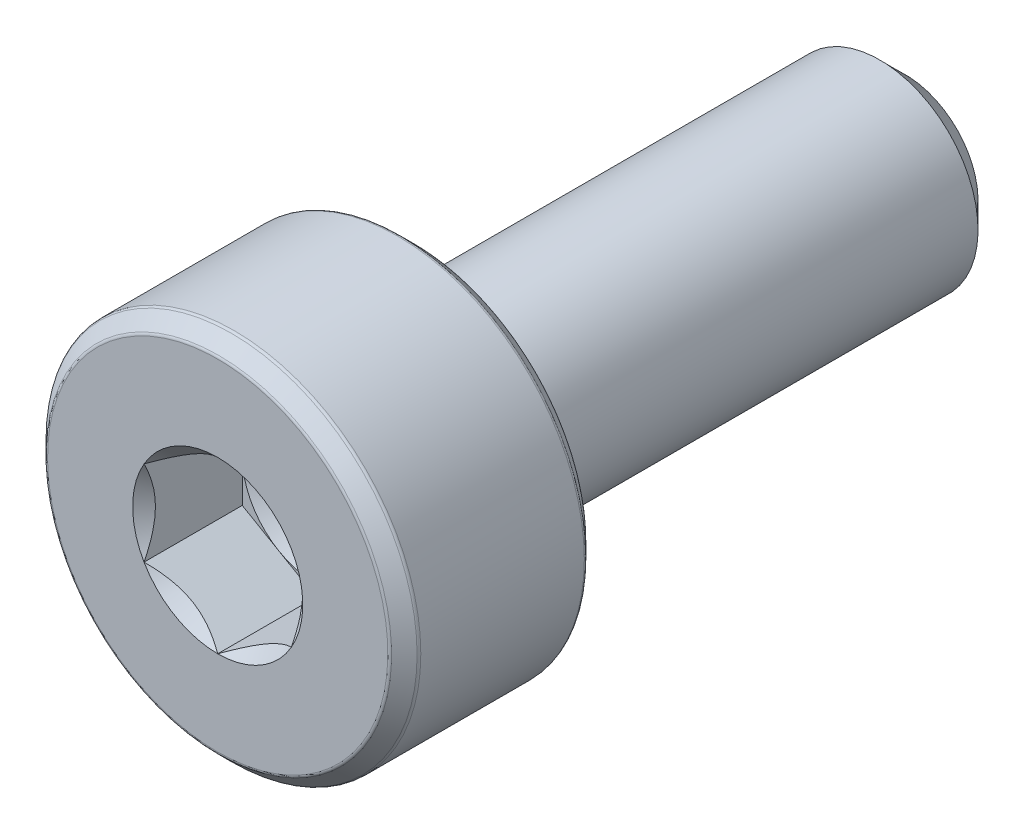
ISO-10303-21;
HEADER;
FILE_DESCRIPTION(('STEP AP214'),'2;1');
FILE_NAME('part.step','',(''),(''),'','','');
FILE_SCHEMA(('AUTOMOTIVE_DESIGN { 1 0 10303 214 1 1 1 1 }'));
ENDSEC;
DATA;
#1=APPLICATION_CONTEXT('core data for automotive mechanical design processes');
#2=APPLICATION_PROTOCOL_DEFINITION('international standard','automotive_design',2000,#1);
#3=PRODUCT_CONTEXT('',#1,'mechanical');
#4=PRODUCT('Part','Part','',(#3));
#5=PRODUCT_RELATED_PRODUCT_CATEGORY('part','',(#4));
#6=PRODUCT_DEFINITION_FORMATION('','',#4);
#7=PRODUCT_DEFINITION_CONTEXT('part definition',#1,'design');
#8=PRODUCT_DEFINITION('design','',#6,#7);
#9=PRODUCT_DEFINITION_SHAPE('','',#8);
#10=(LENGTH_UNIT() NAMED_UNIT(*) SI_UNIT(.MILLI.,.METRE.));
#11=(NAMED_UNIT(*) PLANE_ANGLE_UNIT() SI_UNIT($,.RADIAN.));
#12=(NAMED_UNIT(*) SI_UNIT($,.STERADIAN.) SOLID_ANGLE_UNIT());
#13=UNCERTAINTY_MEASURE_WITH_UNIT(LENGTH_MEASURE(1.E-05),#10,'distance_accuracy_value','');
#14=(GEOMETRIC_REPRESENTATION_CONTEXT(3) GLOBAL_UNCERTAINTY_ASSIGNED_CONTEXT((#13)) GLOBAL_UNIT_ASSIGNED_CONTEXT((#10,
#11,#12)) REPRESENTATION_CONTEXT('',''));
#15=CARTESIAN_POINT('',(0.,0.,0.));
#16=DIRECTION('',(0.,0.,1.));
#17=DIRECTION('',(1.,0.,0.));
#18=AXIS2_PLACEMENT_3D('',#15,#16,#17);
#19=CARTESIAN_POINT('',(0.,0.75,2.5));
#20=DIRECTION('',(0.,0.,-1.));
#21=DIRECTION('',(0.,1.,0.));
#22=AXIS2_PLACEMENT_3D('',#19,#20,#21);
#23=PLANE('',#22);
#24=DIRECTION('',(-0.866025403784439,0.5,0.));
#25=VECTOR('',#24,1.);
#26=CARTESIAN_POINT('',(0.749999999999997,0.433012701892221,2.5));
#27=LINE('',#26,#25);
#28=CARTESIAN_POINT('',(0.749999999999997,0.433012701892221,2.5));
#29=VERTEX_POINT('',#28);
#30=CARTESIAN_POINT('',(0.374999999999999,0.64951905283833,2.5));
#31=VERTEX_POINT('',#30);
#32=EDGE_CURVE('E311',#29,#31,#27,.T.);
#33=ORIENTED_EDGE('',*,*,#32,.T.);
#34=CARTESIAN_POINT('',(0.,0.,2.5));
#35=DIRECTION('',(0.,0.,1.));
#36=DIRECTION('',(1.,0.,0.));
#37=AXIS2_PLACEMENT_3D('',#34,#35,#36);
#38=CIRCLE('',#37,0.749999999999997);
#39=CARTESIAN_POINT('',(0.749999999999997,0.,2.5));
#40=VERTEX_POINT('',#39);
#41=EDGE_CURVE('E55',#40,#31,#38,.T.);
#42=ORIENTED_EDGE('',*,*,#41,.F.);
#43=DIRECTION('',(0.,1.,0.));
#44=VECTOR('',#43,1.);
#45=CARTESIAN_POINT('',(0.749999999999997,-0.433012701892215,2.5));
#46=LINE('',#45,#44);
#47=EDGE_CURVE('E62',#40,#29,#46,.T.);
#48=ORIENTED_EDGE('',*,*,#47,.T.);
#49=EDGE_LOOP('',(#33,#42,#48));
#50=FACE_BOUND('',#49,.T.);
#51=ADVANCED_FACE('F38',(#50),#23,.F.);
#52=CARTESIAN_POINT('',(0.749999999999997,-0.433012701892215,2.5));
#53=VERTEX_POINT('',#52);
#54=EDGE_CURVE('E191',#53,#40,#46,.T.);
#55=ORIENTED_EDGE('',*,*,#54,.T.);
#56=CARTESIAN_POINT('',(0.,0.,2.5));
#57=DIRECTION('',(0.,0.,-1.));
#58=DIRECTION('',(0.,1.,0.));
#59=AXIS2_PLACEMENT_3D('',#56,#57,#58);
#60=CIRCLE('',#59,0.749999999999997);
#61=CARTESIAN_POINT('',(0.374999999999999,-0.649519052838324,2.5));
#62=VERTEX_POINT('',#61);
#63=EDGE_CURVE('E11',#40,#62,#60,.T.);
#64=ORIENTED_EDGE('',*,*,#63,.T.);
#65=DIRECTION('',(0.866025403784439,0.5,0.));
#66=VECTOR('',#65,1.);
#67=CARTESIAN_POINT('',(0.,-0.866025403784432,2.5));
#68=LINE('',#67,#66);
#69=EDGE_CURVE('E186',#62,#53,#68,.T.);
#70=ORIENTED_EDGE('',*,*,#69,.T.);
#71=EDGE_LOOP('',(#55,#64,#70));
#72=FACE_BOUND('',#71,.T.);
#73=ADVANCED_FACE('F125',(#72),#23,.F.);
#74=CARTESIAN_POINT('',(0.,-0.866025403784432,2.5));
#75=VERTEX_POINT('',#74);
#76=EDGE_CURVE('E187',#75,#62,#68,.T.);
#77=ORIENTED_EDGE('',*,*,#76,.T.);
#78=CARTESIAN_POINT('',(-0.374999999999998,-0.649519052838324,2.5));
#79=VERTEX_POINT('',#78);
#80=EDGE_CURVE('E48',#62,#79,#60,.T.);
#81=ORIENTED_EDGE('',*,*,#80,.T.);
#82=DIRECTION('',(0.866025403784439,-0.5,0.));
#83=VECTOR('',#82,1.);
#84=CARTESIAN_POINT('',(-0.749999999999997,-0.433012701892215,2.5));
#85=LINE('',#84,#83);
#86=EDGE_CURVE('E173',#79,#75,#85,.T.);
#87=ORIENTED_EDGE('',*,*,#86,.T.);
#88=EDGE_LOOP('',(#77,#81,#87));
#89=FACE_BOUND('',#88,.T.);
#90=ADVANCED_FACE('F131',(#89),#23,.F.);
#91=CARTESIAN_POINT('',(-0.749999999999997,-0.433012701892215,2.5));
#92=VERTEX_POINT('',#91);
#93=EDGE_CURVE('E178',#92,#79,#85,.T.);
#94=ORIENTED_EDGE('',*,*,#93,.T.);
#95=CARTESIAN_POINT('',(-0.749999999999997,0.,2.5));
#96=VERTEX_POINT('',#95);
#97=EDGE_CURVE('E265',#79,#96,#60,.T.);
#98=ORIENTED_EDGE('',*,*,#97,.T.);
#99=DIRECTION('',(0.,-1.,0.));
#100=VECTOR('',#99,1.);
#101=CARTESIAN_POINT('',(-0.749999999999997,0.433012701892221,2.5));
#102=LINE('',#101,#100);
#103=EDGE_CURVE('E174',#96,#92,#102,.T.);
#104=ORIENTED_EDGE('',*,*,#103,.T.);
#105=EDGE_LOOP('',(#94,#98,#104));
#106=FACE_BOUND('',#105,.T.);
#107=ADVANCED_FACE('F152',(#106),#23,.F.);
#108=CARTESIAN_POINT('',(-0.749999999999997,0.433012701892221,2.5));
#109=VERTEX_POINT('',#108);
#110=EDGE_CURVE('E164',#109,#96,#102,.T.);
#111=ORIENTED_EDGE('',*,*,#110,.T.);
#112=CARTESIAN_POINT('',(-0.374999999999999,0.649519052838329,2.5));
#113=VERTEX_POINT('',#112);
#114=EDGE_CURVE('E165',#96,#113,#60,.T.);
#115=ORIENTED_EDGE('',*,*,#114,.T.);
#116=DIRECTION('',(-0.866025403784439,-0.5,0.));
#117=VECTOR('',#116,1.);
#118=CARTESIAN_POINT('',(0.,0.866025403784438,2.5));
#119=LINE('',#118,#117);
#120=EDGE_CURVE('E167',#113,#109,#119,.T.);
#121=ORIENTED_EDGE('',*,*,#120,.T.);
#122=EDGE_LOOP('',(#111,#115,#121));
#123=FACE_BOUND('',#122,.T.);
#124=ADVANCED_FACE('F139',(#123),#23,.F.);
#125=CARTESIAN_POINT('',(0.,1.73225988462982,3.5));
#126=DIRECTION('',(0.,0.,-1.));
#127=DIRECTION('',(0.,1.,0.));
#128=AXIS2_PLACEMENT_3D('',#125,#126,#127);
#129=PLANE('',#128);
#130=CARTESIAN_POINT('',(0.,0.,3.5));
#131=DIRECTION('',(0.,0.,1.));
#132=DIRECTION('',(1.,0.,0.));
#133=AXIS2_PLACEMENT_3D('',#130,#131,#132);
#134=CIRCLE('',#133,0.866025403784437);
#135=CARTESIAN_POINT('',(0.,0.866025403784437,3.5));
#136=VERTEX_POINT('',#135);
#137=CARTESIAN_POINT('',(-0.749999999999997,0.433012701892221,3.5));
#138=VERTEX_POINT('',#137);
#139=EDGE_CURVE('E288',#136,#138,#134,.T.);
#140=ORIENTED_EDGE('',*,*,#139,.F.);
#141=CARTESIAN_POINT('',(0.,0.,3.5));
#142=DIRECTION('',(0.,0.,1.));
#143=DIRECTION('',(1.,0.,0.));
#144=AXIS2_PLACEMENT_3D('',#141,#142,#143);
#145=CIRCLE('',#144,0.866025403784437);
#146=CARTESIAN_POINT('',(0.749999999999997,0.433012701892221,3.5));
#147=VERTEX_POINT('',#146);
#148=EDGE_CURVE('E382',#147,#136,#145,.T.);
#149=ORIENTED_EDGE('',*,*,#148,.F.);
#150=CARTESIAN_POINT('',(0.,0.,3.5));
#151=DIRECTION('',(0.,0.,1.));
#152=DIRECTION('',(1.,0.,0.));
#153=AXIS2_PLACEMENT_3D('',#150,#151,#152);
#154=CIRCLE('',#153,0.866025403784437);
#155=CARTESIAN_POINT('',(0.750000000000002,-0.433012701892212,3.5));
#156=VERTEX_POINT('',#155);
#157=EDGE_CURVE('E316',#156,#147,#154,.T.);
#158=ORIENTED_EDGE('',*,*,#157,.F.);
#159=CARTESIAN_POINT('',(0.,0.,3.5));
#160=DIRECTION('',(0.,0.,1.));
#161=DIRECTION('',(1.,0.,0.));
#162=AXIS2_PLACEMENT_3D('',#159,#160,#161);
#163=CIRCLE('',#162,0.866025403784437);
#164=CARTESIAN_POINT('',(0.,-0.866025403784437,3.5));
#165=VERTEX_POINT('',#164);
#166=EDGE_CURVE('E355',#165,#156,#163,.T.);
#167=ORIENTED_EDGE('',*,*,#166,.F.);
#168=CARTESIAN_POINT('',(0.,0.,3.5));
#169=DIRECTION('',(0.,0.,1.));
#170=DIRECTION('',(1.,0.,0.));
#171=AXIS2_PLACEMENT_3D('',#168,#169,#170);
#172=CIRCLE('',#171,0.866025403784437);
#173=CARTESIAN_POINT('',(-0.749999999999997,-0.43301270189222,3.5));
#174=VERTEX_POINT('',#173);
#175=EDGE_CURVE('E287',#174,#165,#172,.T.);
#176=ORIENTED_EDGE('',*,*,#175,.F.);
#177=CARTESIAN_POINT('',(0.,0.,3.5));
#178=DIRECTION('',(0.,0.,1.));
#179=DIRECTION('',(1.,0.,0.));
#180=AXIS2_PLACEMENT_3D('',#177,#178,#179);
#181=CIRCLE('',#180,0.866025403784437);
#182=EDGE_CURVE('E372',#138,#174,#181,.T.);
#183=ORIENTED_EDGE('',*,*,#182,.F.);
#184=EDGE_LOOP('',(#140,#149,#158,#167,#176,#183));
#185=FACE_BOUND('',#184,.T.);
#186=CARTESIAN_POINT('',(0.,0.,3.5));
#187=DIRECTION('',(0.,0.,1.));
#188=DIRECTION('',(0.,-1.,0.));
#189=AXIS2_PLACEMENT_3D('',#186,#187,#188);
#190=CIRCLE('',#189,1.73225988462982);
#191=CARTESIAN_POINT('',(0.,-1.73225988462982,3.5));
#192=VERTEX_POINT('',#191);
#193=EDGE_CURVE('E257',#192,#192,#190,.T.);
#194=ORIENTED_EDGE('',*,*,#193,.T.);
#195=EDGE_LOOP('',(#194));
#196=FACE_BOUND('',#195,.T.);
#197=ADVANCED_FACE('F40',(#185,#196),#129,.F.);
#198=CARTESIAN_POINT('',(0.,0.,3.462));
#199=DIRECTION('',(0.,0.,1.));
#200=DIRECTION('',(0.,-1.,0.));
#201=AXIS2_PLACEMENT_3D('',#198,#199,#200);
#202=TOROIDAL_SURFACE('',#201,1.73225988462982,0.0380000000000002);
#203=ORIENTED_EDGE('',*,*,#193,.F.);
#204=EDGE_LOOP('',(#203));
#205=FACE_BOUND('',#204,.T.);
#206=CARTESIAN_POINT('',(0.,0.,3.48887005768509));
#207=DIRECTION('',(0.,0.,1.));
#208=DIRECTION('',(0.,-1.,0.));
#209=AXIS2_PLACEMENT_3D('',#206,#207,#208);
#210=CIRCLE('',#209,1.75912994231491);
#211=CARTESIAN_POINT('',(0.,-1.75912994231491,3.48887005768509));
#212=VERTEX_POINT('',#211);
#213=EDGE_CURVE('E254',#212,#212,#210,.T.);
#214=ORIENTED_EDGE('',*,*,#213,.T.);
#215=EDGE_LOOP('',(#214));
#216=FACE_BOUND('',#215,.T.);
#217=ADVANCED_FACE('F158',(#205,#216),#202,.T.);
#218=CARTESIAN_POINT('',(0.,0.,3.35912994231491));
#219=DIRECTION('',(0.,0.,-1.));
#220=DIRECTION('',(0.,1.,0.));
#221=AXIS2_PLACEMENT_3D('',#218,#219,#220);
#222=CONICAL_SURFACE('',#221,1.88887005768509,0.785398163397454);
#223=ORIENTED_EDGE('',*,*,#213,.F.);
#224=EDGE_LOOP('',(#223));
#225=FACE_BOUND('',#224,.T.);
#226=CARTESIAN_POINT('',(0.,0.,3.35912994231491));
#227=DIRECTION('',(0.,0.,1.));
#228=DIRECTION('',(0.,-1.,0.));
#229=AXIS2_PLACEMENT_3D('',#226,#227,#228);
#230=CIRCLE('',#229,1.88887005768509);
#231=CARTESIAN_POINT('',(0.,-1.88887005768509,3.35912994231491));
#232=VERTEX_POINT('',#231);
#233=EDGE_CURVE('E250',#232,#232,#230,.T.);
#234=ORIENTED_EDGE('',*,*,#233,.T.);
#235=EDGE_LOOP('',(#234));
#236=FACE_BOUND('',#235,.T.);
#237=ADVANCED_FACE('F623',(#225,#236),#222,.T.);
#238=CARTESIAN_POINT('',(0.,0.,3.33225988462983));
#239=DIRECTION('',(0.,0.,1.));
#240=DIRECTION('',(0.,-1.,0.));
#241=AXIS2_PLACEMENT_3D('',#238,#239,#240);
#242=TOROIDAL_SURFACE('',#241,1.862,0.0380000000000002);
#243=ORIENTED_EDGE('',*,*,#233,.F.);
#244=EDGE_LOOP('',(#243));
#245=FACE_BOUND('',#244,.T.);
#246=CARTESIAN_POINT('',(0.,0.,3.33225988462983));
#247=DIRECTION('',(0.,0.,1.));
#248=DIRECTION('',(0.,-1.,0.));
#249=AXIS2_PLACEMENT_3D('',#246,#247,#248);
#250=CIRCLE('',#249,1.9);
#251=CARTESIAN_POINT('',(0.,-1.9,3.33225988462983));
#252=VERTEX_POINT('',#251);
#253=EDGE_CURVE('E246',#252,#252,#250,.T.);
#254=ORIENTED_EDGE('',*,*,#253,.T.);
#255=EDGE_LOOP('',(#254));
#256=FACE_BOUND('',#255,.T.);
#257=ADVANCED_FACE('F613',(#245,#256),#242,.T.);
#258=CARTESIAN_POINT('',(0.,0.,3.5));
#259=DIRECTION('',(0.,0.,1.));
#260=DIRECTION('',(0.,-1.,0.));
#261=AXIS2_PLACEMENT_3D('',#258,#259,#260);
#262=CYLINDRICAL_SURFACE('',#261,1.9);
#263=ORIENTED_EDGE('',*,*,#253,.F.);
#264=EDGE_LOOP('',(#263));
#265=FACE_BOUND('',#264,.T.);
#266=CARTESIAN_POINT('',(0.,0.,1.66774011537018));
#267=DIRECTION('',(0.,0.,1.));
#268=DIRECTION('',(0.,-1.,0.));
#269=AXIS2_PLACEMENT_3D('',#266,#267,#268);
#270=CIRCLE('',#269,1.9);
#271=CARTESIAN_POINT('',(0.,-1.9,1.66774011537018));
#272=VERTEX_POINT('',#271);
#273=EDGE_CURVE('E242',#272,#272,#270,.T.);
#274=ORIENTED_EDGE('',*,*,#273,.T.);
#275=EDGE_LOOP('',(#274));
#276=FACE_BOUND('',#275,.T.);
#277=ADVANCED_FACE('F603',(#265,#276),#262,.T.);
#278=CARTESIAN_POINT('',(0.,0.,1.66774011537018));
#279=DIRECTION('',(0.,0.,1.));
#280=DIRECTION('',(0.,-1.,0.));
#281=AXIS2_PLACEMENT_3D('',#278,#279,#280);
#282=TOROIDAL_SURFACE('',#281,1.862,0.038000000000004);
#283=ORIENTED_EDGE('',*,*,#273,.F.);
#284=EDGE_LOOP('',(#283));
#285=FACE_BOUND('',#284,.T.);
#286=CARTESIAN_POINT('',(0.,0.,1.64087005768509));
#287=DIRECTION('',(0.,0.,1.));
#288=DIRECTION('',(0.,-1.,0.));
#289=AXIS2_PLACEMENT_3D('',#286,#287,#288);
#290=CIRCLE('',#289,1.88887005768509);
#291=CARTESIAN_POINT('',(0.,-1.88887005768509,1.64087005768509));
#292=VERTEX_POINT('',#291);
#293=EDGE_CURVE('E238',#292,#292,#290,.T.);
#294=ORIENTED_EDGE('',*,*,#293,.T.);
#295=EDGE_LOOP('',(#294));
#296=FACE_BOUND('',#295,.T.);
#297=ADVANCED_FACE('F593',(#285,#296),#282,.T.);
#298=CARTESIAN_POINT('',(0.,0.,1.51112994231491));
#299=DIRECTION('',(0.,0.,1.));
#300=DIRECTION('',(0.,-1.,0.));
#301=AXIS2_PLACEMENT_3D('',#298,#299,#300);
#302=CONICAL_SURFACE('',#301,1.75912994231492,0.785398163397423);
#303=ORIENTED_EDGE('',*,*,#293,.F.);
#304=EDGE_LOOP('',(#303));
#305=FACE_BOUND('',#304,.T.);
#306=CARTESIAN_POINT('',(0.,0.,1.51112994231491));
#307=DIRECTION('',(0.,0.,1.));
#308=DIRECTION('',(0.,-1.,0.));
#309=AXIS2_PLACEMENT_3D('',#306,#307,#308);
#310=CIRCLE('',#309,1.75912994231492);
#311=CARTESIAN_POINT('',(0.,-1.75912994231492,1.51112994231491));
#312=VERTEX_POINT('',#311);
#313=EDGE_CURVE('E234',#312,#312,#310,.T.);
#314=ORIENTED_EDGE('',*,*,#313,.T.);
#315=EDGE_LOOP('',(#314));
#316=FACE_BOUND('',#315,.T.);
#317=ADVANCED_FACE('F583',(#305,#316),#302,.T.);
#318=CARTESIAN_POINT('',(0.,0.,1.538));
#319=DIRECTION('',(0.,0.,1.));
#320=DIRECTION('',(0.,-1.,0.));
#321=AXIS2_PLACEMENT_3D('',#318,#319,#320);
#322=TOROIDAL_SURFACE('',#321,1.73225988462984,0.0379999999999999);
#323=ORIENTED_EDGE('',*,*,#313,.F.);
#324=EDGE_LOOP('',(#323));
#325=FACE_BOUND('',#324,.T.);
#326=CARTESIAN_POINT('',(0.,0.,1.5));
#327=DIRECTION('',(0.,0.,1.));
#328=DIRECTION('',(0.,-1.,0.));
#329=AXIS2_PLACEMENT_3D('',#326,#327,#328);
#330=CIRCLE('',#329,1.73225988462984);
#331=CARTESIAN_POINT('',(0.,-1.73225988462983,1.5));
#332=VERTEX_POINT('',#331);
#333=EDGE_CURVE('E230',#332,#332,#330,.T.);
#334=ORIENTED_EDGE('',*,*,#333,.T.);
#335=EDGE_LOOP('',(#334));
#336=FACE_BOUND('',#335,.T.);
#337=ADVANCED_FACE('F573',(#325,#336),#322,.T.);
#338=CARTESIAN_POINT('',(0.,0.999999999999995,1.5));
#339=DIRECTION('',(0.,0.,1.));
#340=DIRECTION('',(0.,-1.,0.));
#341=AXIS2_PLACEMENT_3D('',#338,#339,#340);
#342=PLANE('',#341);
#343=ORIENTED_EDGE('',*,*,#333,.F.);
#344=EDGE_LOOP('',(#343));
#345=FACE_BOUND('',#344,.T.);
#346=CARTESIAN_POINT('',(0.,0.,1.5));
#347=DIRECTION('',(0.,0.,1.));
#348=DIRECTION('',(0.,-1.,0.));
#349=AXIS2_PLACEMENT_3D('',#346,#347,#348);
#350=CIRCLE('',#349,0.999999999999995);
#351=CARTESIAN_POINT('',(0.,-0.999999999999994,1.5));
#352=VERTEX_POINT('',#351);
#353=EDGE_CURVE('E226',#352,#352,#350,.T.);
#354=ORIENTED_EDGE('',*,*,#353,.T.);
#355=EDGE_LOOP('',(#354));
#356=FACE_BOUND('',#355,.T.);
#357=ADVANCED_FACE('F563',(#345,#356),#342,.F.);
#358=CARTESIAN_POINT('',(0.,0.,3.5));
#359=DIRECTION('',(0.,0.,1.));
#360=DIRECTION('',(0.,-1.,0.));
#361=AXIS2_PLACEMENT_3D('',#358,#359,#360);
#362=CYLINDRICAL_SURFACE('',#361,0.999999999999995);
#363=ORIENTED_EDGE('',*,*,#353,.F.);
#364=EDGE_LOOP('',(#363));
#365=FACE_BOUND('',#364,.T.);
#366=CARTESIAN_POINT('',(0.,0.,-3.24019237886467));
#367=DIRECTION('',(0.,0.,1.));
#368=DIRECTION('',(0.,-1.,0.));
#369=AXIS2_PLACEMENT_3D('',#366,#367,#368);
#370=CIRCLE('',#369,0.999999999999995);
#371=CARTESIAN_POINT('',(0.,-0.999999999999994,-3.24019237886467));
#372=VERTEX_POINT('',#371);
#373=EDGE_CURVE('E222',#372,#372,#370,.T.);
#374=ORIENTED_EDGE('',*,*,#373,.T.);
#375=EDGE_LOOP('',(#374));
#376=FACE_BOUND('',#375,.T.);
#377=ADVANCED_FACE('F553',(#365,#376),#362,.T.);
#378=CARTESIAN_POINT('',(0.,0.,-3.5));
#379=DIRECTION('',(0.,0.,1.));
#380=DIRECTION('',(0.,-1.,0.));
#381=AXIS2_PLACEMENT_3D('',#378,#379,#380);
#382=CONICAL_SURFACE('',#381,0.740192378864667,0.78539816339745);
#383=ORIENTED_EDGE('',*,*,#373,.F.);
#384=EDGE_LOOP('',(#383));
#385=FACE_BOUND('',#384,.T.);
#386=CARTESIAN_POINT('',(0.,0.,-3.5));
#387=DIRECTION('',(0.,0.,1.));
#388=DIRECTION('',(0.,-1.,0.));
#389=AXIS2_PLACEMENT_3D('',#386,#387,#388);
#390=CIRCLE('',#389,0.740192378864667);
#391=CARTESIAN_POINT('',(0.,-0.740192378864666,-3.5));
#392=VERTEX_POINT('',#391);
#393=EDGE_CURVE('E200',#392,#392,#390,.T.);
#394=ORIENTED_EDGE('',*,*,#393,.T.);
#395=EDGE_LOOP('',(#394));
#396=FACE_BOUND('',#395,.T.);
#397=ADVANCED_FACE('F544',(#385,#396),#382,.T.);
#398=CARTESIAN_POINT('',(0.,0.,-3.5));
#399=DIRECTION('',(0.,0.,1.));
#400=DIRECTION('',(0.,-1.,0.));
#401=AXIS2_PLACEMENT_3D('',#398,#399,#400);
#402=PLANE('',#401);
#403=ORIENTED_EDGE('',*,*,#393,.F.);
#404=EDGE_LOOP('',(#403));
#405=FACE_BOUND('',#404,.T.);
#406=ADVANCED_FACE('F469',(#405),#402,.F.);
#407=CARTESIAN_POINT('',(0.749999999999997,0.433012701892221,2.5));
#408=DIRECTION('',(0.5,0.866025403784439,0.));
#409=DIRECTION('',(-0.866025403784439,0.5,0.));
#410=AXIS2_PLACEMENT_3D('',#407,#408,#409);
#411=PLANE('',#410);
#412=DIRECTION('',(0.,0.,1.));
#413=VECTOR('',#412,1.);
#414=CARTESIAN_POINT('',(0.749999999999997,0.433012701892221,2.5));
#415=LINE('',#414,#413);
#416=EDGE_CURVE('E196',#29,#147,#415,.T.);
#417=ORIENTED_EDGE('',*,*,#416,.T.);
#418=CARTESIAN_POINT('',(-0.000200000000000054,0.866140873838276,3.50011549314477));
#419=CARTESIAN_POINT('',(0.0255899625576812,0.851251032013209,3.48523411046393));
#420=CARTESIAN_POINT('',(0.0518112021286589,0.836112192288419,3.47122626560696));
#421=CARTESIAN_POINT('',(0.105279708235706,0.805242135894348,3.44557752468226));
#422=CARTESIAN_POINT('',(0.132532067460573,0.789507978959819,3.43395091170567));
#423=CARTESIAN_POINT('',(0.187485350381353,0.757780686272653,3.41403404577225));
#424=CARTESIAN_POINT('',(0.215172256695509,0.741795643459147,3.40569369408137));
#425=CARTESIAN_POINT('',(0.271155595130853,0.709473647943367,3.39284274196143));
#426=CARTESIAN_POINT('',(0.299450314843645,0.693137683900542,3.38832254058884));
#427=CARTESIAN_POINT('',(0.348210289268843,0.664986099540474,3.38424583309744));
#428=CARTESIAN_POINT('',(0.368612065655572,0.65320712845165,3.38364279661408));
#429=CARTESIAN_POINT('',(0.40937613469636,0.629671982217687,3.38465450601553));
#430=CARTESIAN_POINT('',(0.429738417651455,0.617915812672247,3.38626974099004));
#431=CARTESIAN_POINT('',(0.490534543086823,0.582815153286451,3.39433614697304));
#432=CARTESIAN_POINT('',(0.530665854996099,0.559645329552698,3.40400893582772));
#433=CARTESIAN_POINT('',(0.601110400354025,0.518974152327359,3.42735631797232));
#434=CARTESIAN_POINT('',(0.631753572009085,0.501282308923486,3.43980855807225));
#435=CARTESIAN_POINT('',(0.691839345804788,0.46659177124807,3.46785961023086));
#436=CARTESIAN_POINT('',(0.721285488381589,0.449591032904758,3.48344818590375));
#437=CARTESIAN_POINT('',(0.750199999999997,0.432897231838383,3.50011549314477));
#438=B_SPLINE_CURVE_WITH_KNOTS('',3,(#418,#419,#420,#421,#422,#423,#424,#425,#426,#427,#428,
#429,#430,#431,#432,#433,#434,#435,#436,#437),.UNSPECIFIED.,.F.,.F.,(4,2,2,2,2,2,2,2,2,4),(0.,
0.0999419466095594,0.200466857654446,0.299393763705717,0.39807129730023,0.468665775681747,
0.539275821398839,0.680536257244566,0.792918418368072,0.904939568716028),.UNSPECIFIED.);
#439=EDGE_CURVE('E309',#136,#147,#438,.T.);
#440=ORIENTED_EDGE('',*,*,#439,.F.);
#441=DIRECTION('',(0.,0.,1.));
#442=VECTOR('',#441,1.);
#443=CARTESIAN_POINT('',(0.,0.866025403784438,2.5));
#444=LINE('',#443,#442);
#445=CARTESIAN_POINT('',(0.,0.866025403784438,2.5));
#446=VERTEX_POINT('',#445);
#447=EDGE_CURVE('E195',#446,#136,#444,.T.);
#448=ORIENTED_EDGE('',*,*,#447,.F.);
#449=EDGE_CURVE('E312',#31,#446,#27,.T.);
#450=ORIENTED_EDGE('',*,*,#449,.F.);
#451=ORIENTED_EDGE('',*,*,#32,.F.);
#452=EDGE_LOOP('',(#417,#440,#448,#450,#451));
#453=FACE_BOUND('',#452,.T.);
#454=ADVANCED_FACE('F307',(#453),#411,.F.);
#455=CARTESIAN_POINT('',(0.749999999999997,-0.433012701892215,2.5));
#456=DIRECTION('',(1.,0.,0.));
#457=DIRECTION('',(0.,1.,0.));
#458=AXIS2_PLACEMENT_3D('',#455,#456,#457);
#459=PLANE('',#458);
#460=DIRECTION('',(0.,0.,1.));
#461=VECTOR('',#460,1.);
#462=CARTESIAN_POINT('',(0.749999999999997,-0.433012701892215,2.5));
#463=LINE('',#462,#461);
#464=EDGE_CURVE('E201',#53,#156,#463,.T.);
#465=ORIENTED_EDGE('',*,*,#464,.T.);
#466=CARTESIAN_POINT('',(0.749999999999997,-0.863604064848455,3.77778925813539));
#467=CARTESIAN_POINT('',(0.749999999999997,-0.842575879734325,3.76191493200841));
#468=CARTESIAN_POINT('',(0.749999999999997,-0.821430496291553,3.746196265183));
#469=CARTESIAN_POINT('',(0.749999999999997,-0.778857857419012,3.71513452062662));
#470=CARTESIAN_POINT('',(0.749999999999997,-0.757430533042229,3.69979153749355));
#471=CARTESIAN_POINT('',(0.749999999999997,-0.692340710712929,3.65420358029366));
#472=CARTESIAN_POINT('',(0.749999999999997,-0.648190081053407,3.62464409174343));
#473=CARTESIAN_POINT('',(0.749999999999997,-0.555607181501744,3.5666155826928));
#474=CARTESIAN_POINT('',(0.749999999999997,-0.507074363017991,3.53830510936579));
#475=CARTESIAN_POINT('',(0.749999999999997,-0.407587529772332,3.48651811176889));
#476=CARTESIAN_POINT('',(0.749999999999997,-0.356642419548466,3.46302529153185));
#477=CARTESIAN_POINT('',(0.749999999999997,-0.280165468820767,3.43428689950068));
#478=CARTESIAN_POINT('',(0.749999999999997,-0.255770023930568,3.42603927481305));
#479=CARTESIAN_POINT('',(0.749999999999997,-0.206403277885128,3.41149717542019));
#480=CARTESIAN_POINT('',(0.749999999999997,-0.181431937185904,3.40520283526912));
#481=CARTESIAN_POINT('',(0.749999999999997,-0.106699879404922,3.38999317388059));
#482=CARTESIAN_POINT('',(0.749999999999997,-0.0561907171762155,3.38437718471289));
#483=CARTESIAN_POINT('',(0.749999999999997,0.0430767231749072,3.38362825645435));
#484=CARTESIAN_POINT('',(0.749999999999997,0.0918322434166291,3.38812345140561));
#485=CARTESIAN_POINT('',(0.749999999999997,0.164112195698294,3.40133730744598));
#486=CARTESIAN_POINT('',(0.749999999999997,0.188278676879436,3.40690144638208));
#487=CARTESIAN_POINT('',(0.749999999999997,0.236094480120331,3.41992316614872));
#488=CARTESIAN_POINT('',(0.749999999999997,0.259743845273041,3.42738058854766));
#489=CARTESIAN_POINT('',(0.749999999999997,0.334198278463819,3.45366646946609));
#490=CARTESIAN_POINT('',(0.749999999999997,0.383940060445494,3.47549033804844));
#491=CARTESIAN_POINT('',(0.749999999999997,0.481089225076665,3.52401180410059));
#492=CARTESIAN_POINT('',(0.749999999999997,0.528487417973015,3.55072691131035));
#493=CARTESIAN_POINT('',(0.749999999999997,0.619071540465249,3.60584285115078));
#494=CARTESIAN_POINT('',(0.749999999999997,0.662349745300237,3.63409394545219));
#495=CARTESIAN_POINT('',(0.749999999999997,0.726111623216223,3.6777671470975));
#496=CARTESIAN_POINT('',(0.749999999999997,0.747090419255278,3.6924788605167));
#497=CARTESIAN_POINT('',(0.749999999999997,0.788761341501858,3.7222913841024));
#498=CARTESIAN_POINT('',(0.749999999999997,0.809453544535617,3.73739208676303));
#499=CARTESIAN_POINT('',(0.749999999999997,0.830026390097467,3.75265408930473));
#500=B_SPLINE_CURVE_WITH_KNOTS('',3,(#466,#467,#468,#469,#470,#471,#472,#473,#474,#475,#476,
#477,#478,#479,#480,#481,#482,#483,#484,#485,#486,#487,#488,#489,#490,#491,#492,#493,#494,#495,
#496,#497,#498,#499),.UNSPECIFIED.,.F.,.F.,(4,2,2,2,2,2,2,2,2,2,2,2,2,2,2,2,4),(0.,
0.0790398443124672,0.158099390497592,0.317425208674099,0.485845155681373,0.653685658303952,
0.730869805636059,0.808059268704002,0.959469653380772,1.10540290447488,1.17973203111652,
1.25405493988071,1.41653726506053,1.57961304287542,1.73458511695815,1.81145152932465,
1.88829692115809),.UNSPECIFIED.);
#501=EDGE_CURVE('E304',#147,#156,#500,.F.);
#502=ORIENTED_EDGE('',*,*,#501,.F.);
#503=ORIENTED_EDGE('',*,*,#416,.F.);
#504=ORIENTED_EDGE('',*,*,#47,.F.);
#505=ORIENTED_EDGE('',*,*,#54,.F.);
#506=EDGE_LOOP('',(#465,#502,#503,#504,#505));
#507=FACE_BOUND('',#506,.T.);
#508=ADVANCED_FACE('F301',(#507),#459,.F.);
#509=CARTESIAN_POINT('',(0.,-0.866025403784432,2.5));
#510=DIRECTION('',(0.5,-0.866025403784439,0.));
#511=DIRECTION('',(0.866025403784439,0.5,0.));
#512=AXIS2_PLACEMENT_3D('',#509,#510,#511);
#513=PLANE('',#512);
#514=DIRECTION('',(0.,0.,1.));
#515=VECTOR('',#514,1.);
#516=CARTESIAN_POINT('',(0.,-0.866025403784432,2.5));
#517=LINE('',#516,#515);
#518=EDGE_CURVE('E205',#75,#165,#517,.T.);
#519=ORIENTED_EDGE('',*,*,#518,.T.);
#520=CARTESIAN_POINT('',(0.750199999999997,-0.432897231838377,3.50011549314477));
#521=CARTESIAN_POINT('',(0.724410037442316,-0.447787073663445,3.48523411046392));
#522=CARTESIAN_POINT('',(0.698188797871338,-0.462925913388235,3.47122626560695));
#523=CARTESIAN_POINT('',(0.644720291764291,-0.493795969782305,3.44557752468226));
#524=CARTESIAN_POINT('',(0.617467932539424,-0.509530126716834,3.43395091170566));
#525=CARTESIAN_POINT('',(0.562514649618644,-0.541257419404001,3.41403404577224));
#526=CARTESIAN_POINT('',(0.534827743304488,-0.557242462217507,3.40569369408137));
#527=CARTESIAN_POINT('',(0.478844404869144,-0.589564457733286,3.39284274196142));
#528=CARTESIAN_POINT('',(0.450549685156352,-0.605900421776112,3.38832254058883));
#529=CARTESIAN_POINT('',(0.401789710731154,-0.634052006136179,3.38424583309743));
#530=CARTESIAN_POINT('',(0.381387934344425,-0.645830977225004,3.38364279661408));
#531=CARTESIAN_POINT('',(0.340623865303638,-0.669366123458967,3.38465450601552));
#532=CARTESIAN_POINT('',(0.320261582348543,-0.681122293004406,3.38626974099003));
#533=CARTESIAN_POINT('',(0.259465456913174,-0.716222952390202,3.39433614697304));
#534=CARTESIAN_POINT('',(0.219334145003899,-0.739392776123955,3.40400893582772));
#535=CARTESIAN_POINT('',(0.148889599645973,-0.780063953349294,3.42735631797231));
#536=CARTESIAN_POINT('',(0.118246427990913,-0.797755796753168,3.43980855807225));
#537=CARTESIAN_POINT('',(0.0581606541952101,-0.832446334428583,3.46785961023086));
#538=CARTESIAN_POINT('',(0.0287145116184095,-0.849447072771895,3.48344818590375));
#539=CARTESIAN_POINT('',(-0.000199999999999324,-0.86614087383827,3.50011549314477));
#540=B_SPLINE_CURVE_WITH_KNOTS('',3,(#520,#521,#522,#523,#524,#525,#526,#527,#528,#529,#530,
#531,#532,#533,#534,#535,#536,#537,#538,#539),.UNSPECIFIED.,.F.,.F.,(4,2,2,2,2,2,2,2,2,4),(0.,
0.0999419466095594,0.200466857654446,0.299393763705717,0.39807129730023,0.468665775681747,
0.539275821398838,0.680536257244564,0.792918418368071,0.904939568716027),.UNSPECIFIED.);
#541=EDGE_CURVE('E294',#156,#165,#540,.T.);
#542=ORIENTED_EDGE('',*,*,#541,.F.);
#543=ORIENTED_EDGE('',*,*,#464,.F.);
#544=ORIENTED_EDGE('',*,*,#69,.F.);
#545=ORIENTED_EDGE('',*,*,#76,.F.);
#546=EDGE_LOOP('',(#519,#542,#543,#544,#545));
#547=FACE_BOUND('',#546,.T.);
#548=ADVANCED_FACE('F292',(#547),#513,.F.);
#549=CARTESIAN_POINT('',(-0.749999999999997,-0.433012701892215,2.5));
#550=DIRECTION('',(-0.499999999999999,-0.866025403784439,0.));
#551=DIRECTION('',(0.866025403784439,-0.5,0.));
#552=AXIS2_PLACEMENT_3D('',#549,#550,#551);
#553=PLANE('',#552);
#554=DIRECTION('',(0.,0.,1.));
#555=VECTOR('',#554,1.);
#556=CARTESIAN_POINT('',(-0.749999999999997,-0.433012701892215,2.5));
#557=LINE('',#556,#555);
#558=EDGE_CURVE('E209',#92,#174,#557,.T.);
#559=ORIENTED_EDGE('',*,*,#558,.T.);
#560=CARTESIAN_POINT('',(0.000200000000000653,-0.86614087383827,3.50011549314477));
#561=CARTESIAN_POINT('',(-0.0255899625576808,-0.851251032013202,3.48523411046392));
#562=CARTESIAN_POINT('',(-0.0518112021286584,-0.836112192288413,3.47122626560695));
#563=CARTESIAN_POINT('',(-0.105279708235705,-0.805242135894342,3.44557752468225));
#564=CARTESIAN_POINT('',(-0.132532067460572,-0.789507978959813,3.43395091170566));
#565=CARTESIAN_POINT('',(-0.187485350381352,-0.757780686272647,3.41403404577224));
#566=CARTESIAN_POINT('',(-0.215172256695508,-0.741795643459141,3.40569369408137));
#567=CARTESIAN_POINT('',(-0.271155595130851,-0.709473647943362,3.39284274196142));
#568=CARTESIAN_POINT('',(-0.299450314843643,-0.693137683900537,3.38832254058883));
#569=CARTESIAN_POINT('',(-0.348210289268841,-0.664986099540469,3.38424583309743));
#570=CARTESIAN_POINT('',(-0.36861206565557,-0.653207128451645,3.38364279661408));
#571=CARTESIAN_POINT('',(-0.409376134696357,-0.629671982217682,3.38465450601552));
#572=CARTESIAN_POINT('',(-0.429738417651452,-0.617915812672243,3.38626974099003));
#573=CARTESIAN_POINT('',(-0.49053454308682,-0.582815153286447,3.39433614697304));
#574=CARTESIAN_POINT('',(-0.530665854996095,-0.559645329552694,3.40400893582772));
#575=CARTESIAN_POINT('',(-0.601110400354022,-0.518974152327354,3.42735631797231));
#576=CARTESIAN_POINT('',(-0.631753572009083,-0.501282308923481,3.43980855807225));
#577=CARTESIAN_POINT('',(-0.691839345804787,-0.466591771248064,3.46785961023086));
#578=CARTESIAN_POINT('',(-0.721285488381588,-0.449591032904752,3.48344818590375));
#579=CARTESIAN_POINT('',(-0.750199999999998,-0.432897231838377,3.50011549314477));
#580=B_SPLINE_CURVE_WITH_KNOTS('',3,(#560,#561,#562,#563,#564,#565,#566,#567,#568,#569,#570,
#571,#572,#573,#574,#575,#576,#577,#578,#579),.UNSPECIFIED.,.F.,.F.,(4,2,2,2,2,2,2,2,2,4),(0.,
0.0999419466095591,0.200466857654445,0.299393763705716,0.398071297300228,0.468665775681745,
0.539275821398836,0.680536257244562,0.79291841836807,0.904939568716029),.UNSPECIFIED.);
#581=EDGE_CURVE('E282',#165,#174,#580,.T.);
#582=ORIENTED_EDGE('',*,*,#581,.F.);
#583=ORIENTED_EDGE('',*,*,#518,.F.);
#584=ORIENTED_EDGE('',*,*,#86,.F.);
#585=ORIENTED_EDGE('',*,*,#93,.F.);
#586=EDGE_LOOP('',(#559,#582,#583,#584,#585));
#587=FACE_BOUND('',#586,.T.);
#588=ADVANCED_FACE('F276',(#587),#553,.F.);
#589=CARTESIAN_POINT('',(-0.749999999999997,0.433012701892221,2.5));
#590=DIRECTION('',(-1.,0.,0.));
#591=DIRECTION('',(0.,0.,1.));
#592=AXIS2_PLACEMENT_3D('',#589,#590,#591);
#593=PLANE('',#592);
#594=DIRECTION('',(0.,0.,1.));
#595=VECTOR('',#594,1.);
#596=CARTESIAN_POINT('',(-0.749999999999997,0.433012701892221,2.5));
#597=LINE('',#596,#595);
#598=EDGE_CURVE('E213',#109,#138,#597,.T.);
#599=ORIENTED_EDGE('',*,*,#598,.T.);
#600=CARTESIAN_POINT('',(-0.749999999999997,-0.863604064848454,3.77778925813539));
#601=CARTESIAN_POINT('',(-0.749999999999997,-0.842575879734324,3.7619149320084));
#602=CARTESIAN_POINT('',(-0.749999999999997,-0.821430496291552,3.746196265183));
#603=CARTESIAN_POINT('',(-0.749999999999997,-0.778857857419011,3.71513452062662));
#604=CARTESIAN_POINT('',(-0.749999999999997,-0.757430533042228,3.69979153749355));
#605=CARTESIAN_POINT('',(-0.749999999999997,-0.692340710712929,3.65420358029366));
#606=CARTESIAN_POINT('',(-0.749999999999997,-0.648190081053406,3.62464409174343));
#607=CARTESIAN_POINT('',(-0.749999999999997,-0.555607181501743,3.5666155826928));
#608=CARTESIAN_POINT('',(-0.749999999999997,-0.50707436301799,3.53830510936579));
#609=CARTESIAN_POINT('',(-0.749999999999997,-0.407587529772332,3.48651811176889));
#610=CARTESIAN_POINT('',(-0.749999999999997,-0.356642419548466,3.46302529153185));
#611=CARTESIAN_POINT('',(-0.749999999999997,-0.280165468820767,3.43428689950068));
#612=CARTESIAN_POINT('',(-0.749999999999997,-0.255770023930568,3.42603927481305));
#613=CARTESIAN_POINT('',(-0.749999999999997,-0.206403277885128,3.41149717542019));
#614=CARTESIAN_POINT('',(-0.749999999999997,-0.181431937185904,3.40520283526912));
#615=CARTESIAN_POINT('',(-0.749999999999997,-0.106699879404922,3.3899931738806));
#616=CARTESIAN_POINT('',(-0.749999999999997,-0.0561907171762151,3.38437718471289));
#617=CARTESIAN_POINT('',(-0.749999999999997,0.0430767231749078,3.38362825645435));
#618=CARTESIAN_POINT('',(-0.749999999999997,0.0918322434166297,3.38812345140561));
#619=CARTESIAN_POINT('',(-0.749999999999997,0.164112195698295,3.40133730744598));
#620=CARTESIAN_POINT('',(-0.749999999999997,0.188278676879437,3.40690144638208));
#621=CARTESIAN_POINT('',(-0.749999999999997,0.236094480120331,3.41992316614873));
#622=CARTESIAN_POINT('',(-0.749999999999997,0.259743845273041,3.42738058854766));
#623=CARTESIAN_POINT('',(-0.749999999999997,0.334198278463819,3.45366646946609));
#624=CARTESIAN_POINT('',(-0.749999999999997,0.383940060445494,3.47549033804844));
#625=CARTESIAN_POINT('',(-0.749999999999997,0.481089225076665,3.52401180410059));
#626=CARTESIAN_POINT('',(-0.749999999999997,0.528487417973016,3.55072691131035));
#627=CARTESIAN_POINT('',(-0.749999999999997,0.61907154046525,3.60584285115078));
#628=CARTESIAN_POINT('',(-0.749999999999997,0.662349745300238,3.63409394545219));
#629=CARTESIAN_POINT('',(-0.749999999999997,0.726111623216223,3.6777671470975));
#630=CARTESIAN_POINT('',(-0.749999999999997,0.747090419255279,3.6924788605167));
#631=CARTESIAN_POINT('',(-0.749999999999997,0.788761341501858,3.7222913841024));
#632=CARTESIAN_POINT('',(-0.749999999999997,0.809453544535618,3.73739208676303));
#633=CARTESIAN_POINT('',(-0.749999999999997,0.830026390097467,3.75265408930473));
#634=B_SPLINE_CURVE_WITH_KNOTS('',3,(#600,#601,#602,#603,#604,#605,#606,#607,#608,#609,#610,
#611,#612,#613,#614,#615,#616,#617,#618,#619,#620,#621,#622,#623,#624,#625,#626,#627,#628,#629,
#630,#631,#632,#633),.UNSPECIFIED.,.F.,.F.,(4,2,2,2,2,2,2,2,2,2,2,2,2,2,2,2,4),(0.,
0.079039844312467,0.158099390497591,0.317425208674098,0.485845155681373,0.65368565830395,
0.730869805636058,0.808059268704001,0.959469653380771,1.10540290447488,1.17973203111652,
1.25405493988071,1.41653726506052,1.57961304287542,1.73458511695814,1.81145152932465,
1.88829692115809),.UNSPECIFIED.);
#635=EDGE_CURVE('E280',#174,#138,#634,.T.);
#636=ORIENTED_EDGE('',*,*,#635,.F.);
#637=ORIENTED_EDGE('',*,*,#558,.F.);
#638=ORIENTED_EDGE('',*,*,#103,.F.);
#639=ORIENTED_EDGE('',*,*,#110,.F.);
#640=EDGE_LOOP('',(#599,#636,#637,#638,#639));
#641=FACE_BOUND('',#640,.T.);
#642=ADVANCED_FACE('F147',(#641),#593,.F.);
#643=CARTESIAN_POINT('',(0.,0.866025403784438,2.5));
#644=DIRECTION('',(-0.5,0.866025403784439,0.));
#645=DIRECTION('',(-0.866025403784439,-0.5,0.));
#646=AXIS2_PLACEMENT_3D('',#643,#644,#645);
#647=PLANE('',#646);
#648=ORIENTED_EDGE('',*,*,#447,.T.);
#649=CARTESIAN_POINT('',(-0.750199999999997,0.432897231838383,3.50011549314477));
#650=CARTESIAN_POINT('',(-0.724410037442316,0.44778707366345,3.48523411046392));
#651=CARTESIAN_POINT('',(-0.698188797871339,0.46292591338824,3.47122626560696));
#652=CARTESIAN_POINT('',(-0.644720291764292,0.49379596978231,3.44557752468226));
#653=CARTESIAN_POINT('',(-0.617467932539426,0.509530126716839,3.43395091170567));
#654=CARTESIAN_POINT('',(-0.562514649618646,0.541257419404005,3.41403404577225));
#655=CARTESIAN_POINT('',(-0.534827743304489,0.557242462217511,3.40569369408137));
#656=CARTESIAN_POINT('',(-0.478844404869146,0.589564457733291,3.39284274196143));
#657=CARTESIAN_POINT('',(-0.450549685156355,0.605900421776116,3.38832254058884));
#658=CARTESIAN_POINT('',(-0.401789710731156,0.634052006136183,3.38424583309744));
#659=CARTESIAN_POINT('',(-0.381387934344427,0.645830977225008,3.38364279661408));
#660=CARTESIAN_POINT('',(-0.34062386530364,0.669366123458971,3.38465450601553));
#661=CARTESIAN_POINT('',(-0.320261582348545,0.681122293004411,3.38626974099004));
#662=CARTESIAN_POINT('',(-0.259465456913176,0.716222952390207,3.39433614697304));
#663=CARTESIAN_POINT('',(-0.219334145003901,0.73939277612396,3.40400893582772));
#664=CARTESIAN_POINT('',(-0.148889599645974,0.7800639533493,3.42735631797232));
#665=CARTESIAN_POINT('',(-0.118246427990914,0.797755796753173,3.43980855807225));
#666=CARTESIAN_POINT('',(-0.0581606541952103,0.832446334428589,3.46785961023086));
#667=CARTESIAN_POINT('',(-0.0287145116184093,0.849447072771901,3.48344818590375));
#668=CARTESIAN_POINT('',(0.000199999999999862,0.866140873838276,3.50011549314477));
#669=B_SPLINE_CURVE_WITH_KNOTS('',3,(#649,#650,#651,#652,#653,#654,#655,#656,#657,#658,#659,
#660,#661,#662,#663,#664,#665,#666,#667,#668),.UNSPECIFIED.,.F.,.F.,(4,2,2,2,2,2,2,2,2,4),(0.,
0.0999419466095588,0.200466857654445,0.299393763705715,0.398071297300227,0.468665775681745,
0.539275821398836,0.680536257244563,0.792918418368071,0.904939568716028),.UNSPECIFIED.);
#670=EDGE_CURVE('E347',#138,#136,#669,.T.);
#671=ORIENTED_EDGE('',*,*,#670,.F.);
#672=ORIENTED_EDGE('',*,*,#598,.F.);
#673=ORIENTED_EDGE('',*,*,#120,.F.);
#674=EDGE_CURVE('E180',#446,#113,#119,.T.);
#675=ORIENTED_EDGE('',*,*,#674,.F.);
#676=EDGE_LOOP('',(#648,#671,#672,#673,#675));
#677=FACE_BOUND('',#676,.T.);
#678=ADVANCED_FACE('F137',(#677),#647,.F.);
#679=ORIENTED_EDGE('',*,*,#674,.T.);
#680=EDGE_CURVE('E42',#113,#31,#60,.T.);
#681=ORIENTED_EDGE('',*,*,#680,.T.);
#682=ORIENTED_EDGE('',*,*,#449,.T.);
#683=EDGE_LOOP('',(#679,#681,#682));
#684=FACE_BOUND('',#683,.T.);
#685=ADVANCED_FACE('F127',(#684),#23,.F.);
#686=CARTESIAN_POINT('',(0.,0.,3.5));
#687=DIRECTION('',(0.,0.,1.));
#688=DIRECTION('',(1.,0.,0.));
#689=AXIS2_PLACEMENT_3D('',#686,#687,#688);
#690=CONICAL_SURFACE('',#689,0.866025403784437,0.78539816339745);
#691=ORIENTED_EDGE('',*,*,#670,.T.);
#692=ORIENTED_EDGE('',*,*,#139,.T.);
#693=EDGE_LOOP('',(#691,#692));
#694=FACE_BOUND('',#693,.T.);
#695=ADVANCED_FACE('F136',(#694),#690,.F.);
#696=CARTESIAN_POINT('',(0.,0.,3.5));
#697=DIRECTION('',(0.,0.,1.));
#698=DIRECTION('',(1.,0.,0.));
#699=AXIS2_PLACEMENT_3D('',#696,#697,#698);
#700=CONICAL_SURFACE('',#699,0.866025403784437,0.78539816339745);
#701=ORIENTED_EDGE('',*,*,#581,.T.);
#702=ORIENTED_EDGE('',*,*,#175,.T.);
#703=EDGE_LOOP('',(#701,#702));
#704=FACE_BOUND('',#703,.T.);
#705=ADVANCED_FACE('F144',(#704),#700,.F.);
#706=CARTESIAN_POINT('',(0.,0.,3.5));
#707=DIRECTION('',(0.,0.,1.));
#708=DIRECTION('',(1.,0.,0.));
#709=AXIS2_PLACEMENT_3D('',#706,#707,#708);
#710=CONICAL_SURFACE('',#709,0.866025403784437,0.78539816339745);
#711=ORIENTED_EDGE('',*,*,#501,.T.);
#712=ORIENTED_EDGE('',*,*,#157,.T.);
#713=EDGE_LOOP('',(#711,#712));
#714=FACE_BOUND('',#713,.T.);
#715=ADVANCED_FACE('F331',(#714),#710,.F.);
#716=CARTESIAN_POINT('',(0.,0.,3.5));
#717=DIRECTION('',(0.,0.,1.));
#718=DIRECTION('',(1.,0.,0.));
#719=AXIS2_PLACEMENT_3D('',#716,#717,#718);
#720=CONICAL_SURFACE('',#719,0.866025403784437,0.78539816339745);
#721=ORIENTED_EDGE('',*,*,#541,.T.);
#722=ORIENTED_EDGE('',*,*,#166,.T.);
#723=EDGE_LOOP('',(#721,#722));
#724=FACE_BOUND('',#723,.T.);
#725=ADVANCED_FACE('F335',(#724),#720,.F.);
#726=CARTESIAN_POINT('',(0.,0.,3.5));
#727=DIRECTION('',(0.,0.,1.));
#728=DIRECTION('',(1.,0.,0.));
#729=AXIS2_PLACEMENT_3D('',#726,#727,#728);
#730=CONICAL_SURFACE('',#729,0.866025403784437,0.78539816339745);
#731=ORIENTED_EDGE('',*,*,#635,.T.);
#732=ORIENTED_EDGE('',*,*,#182,.T.);
#733=EDGE_LOOP('',(#731,#732));
#734=FACE_BOUND('',#733,.T.);
#735=ADVANCED_FACE('F120',(#734),#730,.F.);
#736=CARTESIAN_POINT('',(0.,0.,3.5));
#737=DIRECTION('',(0.,0.,1.));
#738=DIRECTION('',(1.,0.,0.));
#739=AXIS2_PLACEMENT_3D('',#736,#737,#738);
#740=CONICAL_SURFACE('',#739,0.866025403784437,0.78539816339745);
#741=ORIENTED_EDGE('',*,*,#439,.T.);
#742=ORIENTED_EDGE('',*,*,#148,.T.);
#743=EDGE_LOOP('',(#741,#742));
#744=FACE_BOUND('',#743,.T.);
#745=ADVANCED_FACE('F115',(#744),#740,.F.);
#746=CARTESIAN_POINT('',(0.,0.,2.5));
#747=DIRECTION('',(0.,0.,1.));
#748=DIRECTION('',(1.,0.,0.));
#749=AXIS2_PLACEMENT_3D('',#746,#747,#748);
#750=CONICAL_SURFACE('',#749,0.749999999999997,1.0471975511966);
#751=CARTESIAN_POINT('',(0.,0.,2.06698729810779));
#752=VERTEX_POINT('',#751);
#753=VERTEX_LOOP('',#752);
#754=FACE_BOUND('',#753,.T.);
#755=ORIENTED_EDGE('',*,*,#41,.T.);
#756=ORIENTED_EDGE('',*,*,#680,.F.);
#757=ORIENTED_EDGE('',*,*,#114,.F.);
#758=ORIENTED_EDGE('',*,*,#97,.F.);
#759=ORIENTED_EDGE('',*,*,#80,.F.);
#760=ORIENTED_EDGE('',*,*,#63,.F.);
#761=EDGE_LOOP('',(#755,#756,#757,#758,#759,#760));
#762=FACE_BOUND('',#761,.T.);
#763=ADVANCED_FACE('F113',(#754,#762),#750,.F.);
#764=CLOSED_SHELL('',(#51,#73,#90,#107,#124,#197,#217,#237,#257,#277,#297,#317,#337,#357,#377,
#397,#406,#454,#508,#548,#588,#642,#678,#685,#695,#705,#715,#725,#735,#745,#763));
#765=MANIFOLD_SOLID_BREP('B2',#764);
#766=ADVANCED_BREP_SHAPE_REPRESENTATION('',(#18,#765),#14);
#767=SHAPE_DEFINITION_REPRESENTATION(#9,#766);
ENDSEC;
END-ISO-10303-21;
